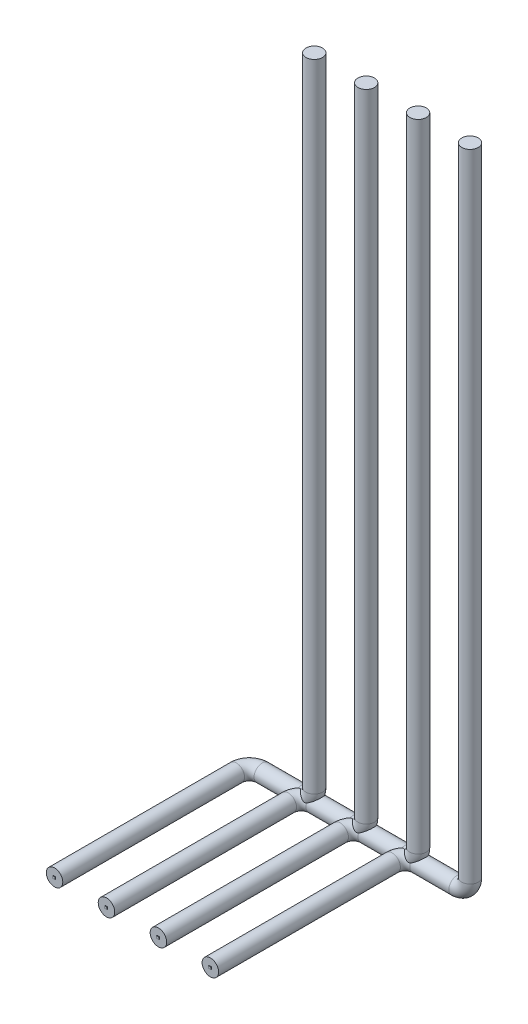
ISO-10303-21;
HEADER;
FILE_DESCRIPTION(('STEP AP214'),'2;1');
FILE_NAME('part.step','',(''),(''),'','','');
FILE_SCHEMA(('AUTOMOTIVE_DESIGN { 1 0 10303 214 1 1 1 1 }'));
ENDSEC;
DATA;
#1=APPLICATION_CONTEXT('core data for automotive mechanical design processes');
#2=APPLICATION_PROTOCOL_DEFINITION('international standard','automotive_design',2000,#1);
#3=PRODUCT_CONTEXT('',#1,'mechanical');
#4=PRODUCT('Part','Part','',(#3));
#5=PRODUCT_RELATED_PRODUCT_CATEGORY('part','',(#4));
#6=PRODUCT_DEFINITION_FORMATION('','',#4);
#7=PRODUCT_DEFINITION_CONTEXT('part definition',#1,'design');
#8=PRODUCT_DEFINITION('design','',#6,#7);
#9=PRODUCT_DEFINITION_SHAPE('','',#8);
#10=(LENGTH_UNIT() NAMED_UNIT(*) SI_UNIT(.MILLI.,.METRE.));
#11=(NAMED_UNIT(*) PLANE_ANGLE_UNIT() SI_UNIT($,.RADIAN.));
#12=(NAMED_UNIT(*) SI_UNIT($,.STERADIAN.) SOLID_ANGLE_UNIT());
#13=UNCERTAINTY_MEASURE_WITH_UNIT(LENGTH_MEASURE(1.E-05),#10,'distance_accuracy_value','');
#14=(GEOMETRIC_REPRESENTATION_CONTEXT(3) GLOBAL_UNCERTAINTY_ASSIGNED_CONTEXT((#13)) GLOBAL_UNIT_ASSIGNED_CONTEXT((#10,
#11,#12)) REPRESENTATION_CONTEXT('',''));
#15=CARTESIAN_POINT('',(0.,0.,0.));
#16=DIRECTION('',(0.,0.,1.));
#17=DIRECTION('',(1.,0.,0.));
#18=AXIS2_PLACEMENT_3D('',#15,#16,#17);
#19=CARTESIAN_POINT('',(240.,0.,0.));
#20=DIRECTION('',(0.,0.,1.));
#21=DIRECTION('',(1.,0.,0.));
#22=AXIS2_PLACEMENT_3D('',#19,#20,#21);
#23=PLANE('',#22);
#24=CARTESIAN_POINT('',(240.,0.,0.));
#25=DIRECTION('',(0.,0.,1.));
#26=DIRECTION('',(1.,0.,0.));
#27=AXIS2_PLACEMENT_3D('',#24,#25,#26);
#28=CIRCLE('',#27,12.7);
#29=CARTESIAN_POINT('',(252.7,0.,0.));
#30=VERTEX_POINT('',#29);
#31=EDGE_CURVE('E64',#30,#30,#28,.T.);
#32=ORIENTED_EDGE('',*,*,#31,.T.);
#33=EDGE_LOOP('',(#32));
#34=FACE_BOUND('',#33,.T.);
#35=DIRECTION('',(-1.,0.,0.));
#36=VECTOR('',#35,1.);
#37=CARTESIAN_POINT('',(238.188257404063,1.656281223361,0.));
#38=LINE('',#37,#36);
#39=CARTESIAN_POINT('',(241.811742595937,1.656281223361,0.));
#40=VERTEX_POINT('',#39);
#41=CARTESIAN_POINT('',(238.188257404063,1.656281223361,0.));
#42=VERTEX_POINT('',#41);
#43=EDGE_CURVE('E153',#40,#42,#38,.T.);
#44=ORIENTED_EDGE('',*,*,#43,.F.);
#45=DIRECTION('',(0.,1.,0.));
#46=VECTOR('',#45,1.);
#47=CARTESIAN_POINT('',(241.811742595937,-1.656281223361,0.));
#48=LINE('',#47,#46);
#49=CARTESIAN_POINT('',(241.811742595937,-1.656281223361,0.));
#50=VERTEX_POINT('',#49);
#51=EDGE_CURVE('E111',#50,#40,#48,.T.);
#52=ORIENTED_EDGE('',*,*,#51,.F.);
#53=DIRECTION('',(1.,0.,0.));
#54=VECTOR('',#53,1.);
#55=CARTESIAN_POINT('',(238.188257404063,-1.656281223361,0.));
#56=LINE('',#55,#54);
#57=CARTESIAN_POINT('',(238.188257404063,-1.656281223361,0.));
#58=VERTEX_POINT('',#57);
#59=EDGE_CURVE('E107',#58,#50,#56,.T.);
#60=ORIENTED_EDGE('',*,*,#59,.F.);
#61=DIRECTION('',(0.,-1.,0.));
#62=VECTOR('',#61,1.);
#63=CARTESIAN_POINT('',(238.188257404063,-1.656281223361,0.));
#64=LINE('',#63,#62);
#65=EDGE_CURVE('E155',#42,#58,#64,.T.);
#66=ORIENTED_EDGE('',*,*,#65,.F.);
#67=EDGE_LOOP('',(#44,#52,#60,#66));
#68=FACE_BOUND('',#67,.T.);
#69=ADVANCED_FACE('F44',(#34,#68),#23,.T.);
#70=CARTESIAN_POINT('',(340.,1000.,-300.));
#71=DIRECTION('',(0.,-1.,0.));
#72=DIRECTION('',(0.,0.,1.));
#73=AXIS2_PLACEMENT_3D('',#70,#71,#72);
#74=PLANE('',#73);
#75=CARTESIAN_POINT('',(340.,1000.,-300.));
#76=DIRECTION('',(0.,-1.,0.));
#77=DIRECTION('',(0.,0.,1.));
#78=AXIS2_PLACEMENT_3D('',#75,#76,#77);
#79=CIRCLE('',#78,12.7);
#80=CARTESIAN_POINT('',(340.,1000.,-287.3));
#81=VERTEX_POINT('',#80);
#82=EDGE_CURVE('E12',#81,#81,#79,.T.);
#83=ORIENTED_EDGE('',*,*,#82,.F.);
#84=EDGE_LOOP('',(#83));
#85=FACE_BOUND('',#84,.T.);
#86=ADVANCED_FACE('F141',(#85),#74,.F.);
#87=CARTESIAN_POINT('',(240.,0.,0.));
#88=DIRECTION('',(0.,0.,-1.));
#89=DIRECTION('',(-1.,0.,0.));
#90=AXIS2_PLACEMENT_3D('',#87,#88,#89);
#91=CYLINDRICAL_SURFACE('',#90,12.7);
#92=CARTESIAN_POINT('',(240.,0.,-280.));
#93=DIRECTION('',(0.,0.,1.));
#94=DIRECTION('',(1.,0.,0.));
#95=AXIS2_PLACEMENT_3D('',#92,#93,#94);
#96=CIRCLE('',#95,12.7);
#97=CARTESIAN_POINT('',(227.3,0.,-280.));
#98=VERTEX_POINT('',#97);
#99=EDGE_CURVE('E114',#98,#98,#96,.T.);
#100=ORIENTED_EDGE('',*,*,#99,.T.);
#101=EDGE_LOOP('',(#100));
#102=FACE_BOUND('',#101,.T.);
#103=ORIENTED_EDGE('',*,*,#31,.F.);
#104=EDGE_LOOP('',(#103));
#105=FACE_BOUND('',#104,.T.);
#106=ADVANCED_FACE('F149',(#102,#105),#91,.T.);
#107=CARTESIAN_POINT('',(260.,0.,-280.));
#108=DIRECTION('',(0.,-1.,0.));
#109=DIRECTION('',(0.,0.,-1.));
#110=AXIS2_PLACEMENT_3D('',#107,#108,#109);
#111=TOROIDAL_SURFACE('',#110,20.,12.7);
#112=CARTESIAN_POINT('',(260.,0.,-300.));
#113=DIRECTION('',(-1.,0.,0.));
#114=DIRECTION('',(0.,0.,1.));
#115=AXIS2_PLACEMENT_3D('',#112,#113,#114);
#116=CIRCLE('',#115,12.7);
#117=CARTESIAN_POINT('',(260.,0.,-312.7));
#118=VERTEX_POINT('',#117);
#119=EDGE_CURVE('E121',#118,#118,#116,.T.);
#120=CARTESIAN_POINT('',(260.,0.,-280.));
#121=DIRECTION('',(0.,-1.,0.));
#122=DIRECTION('',(0.,0.,-1.));
#123=AXIS2_PLACEMENT_3D('',#120,#121,#122);
#124=CIRCLE('',#123,32.7);
#125=EDGE_CURVE('',#98,#118,#124,.T.);
#126=ORIENTED_EDGE('',*,*,#99,.F.);
#127=ORIENTED_EDGE('',*,*,#119,.T.);
#128=ORIENTED_EDGE('',*,*,#125,.T.);
#129=ORIENTED_EDGE('',*,*,#125,.F.);
#130=EDGE_LOOP('',(#126,#128,#127,#129));
#131=FACE_BOUND('',#130,.T.);
#132=ADVANCED_FACE('F180',(#131),#111,.T.);
#133=CARTESIAN_POINT('',(260.,0.,-300.));
#134=DIRECTION('',(1.,0.,0.));
#135=DIRECTION('',(0.,0.,-1.));
#136=AXIS2_PLACEMENT_3D('',#133,#134,#135);
#137=CYLINDRICAL_SURFACE('',#136,12.7);
#138=CARTESIAN_POINT('',(320.,0.,-300.));
#139=DIRECTION('',(-1.,0.,0.));
#140=DIRECTION('',(0.,0.,1.));
#141=AXIS2_PLACEMENT_3D('',#138,#139,#140);
#142=CIRCLE('',#141,12.7);
#143=CARTESIAN_POINT('',(320.,-12.7,-300.));
#144=VERTEX_POINT('',#143);
#145=EDGE_CURVE('E124',#144,#144,#142,.T.);
#146=ORIENTED_EDGE('',*,*,#145,.T.);
#147=EDGE_LOOP('',(#146));
#148=FACE_BOUND('',#147,.T.);
#149=ORIENTED_EDGE('',*,*,#119,.F.);
#150=EDGE_LOOP('',(#149));
#151=FACE_BOUND('',#150,.T.);
#152=ADVANCED_FACE('F142',(#148,#151),#137,.T.);
#153=CARTESIAN_POINT('',(320.,20.,-300.));
#154=DIRECTION('',(0.,0.,1.));
#155=DIRECTION('',(1.,0.,0.));
#156=AXIS2_PLACEMENT_3D('',#153,#154,#155);
#157=TOROIDAL_SURFACE('',#156,20.,12.7);
#158=CARTESIAN_POINT('',(340.,20.,-300.));
#159=DIRECTION('',(0.,-1.,0.));
#160=DIRECTION('',(0.,0.,1.));
#161=AXIS2_PLACEMENT_3D('',#158,#159,#160);
#162=CIRCLE('',#161,12.7);
#163=CARTESIAN_POINT('',(352.7,20.,-300.));
#164=VERTEX_POINT('',#163);
#165=EDGE_CURVE('E51',#164,#164,#162,.T.);
#166=CARTESIAN_POINT('',(320.,20.,-300.));
#167=DIRECTION('',(0.,0.,1.));
#168=DIRECTION('',(1.,0.,0.));
#169=AXIS2_PLACEMENT_3D('',#166,#167,#168);
#170=CIRCLE('',#169,32.7);
#171=EDGE_CURVE('',#144,#164,#170,.T.);
#172=ORIENTED_EDGE('',*,*,#145,.F.);
#173=ORIENTED_EDGE('',*,*,#165,.T.);
#174=ORIENTED_EDGE('',*,*,#171,.T.);
#175=ORIENTED_EDGE('',*,*,#171,.F.);
#176=EDGE_LOOP('',(#172,#174,#173,#175));
#177=FACE_BOUND('',#176,.T.);
#178=ADVANCED_FACE('F129',(#177),#157,.T.);
#179=CARTESIAN_POINT('',(340.,20.,-300.));
#180=DIRECTION('',(0.,1.,0.));
#181=DIRECTION('',(0.,0.,1.));
#182=AXIS2_PLACEMENT_3D('',#179,#180,#181);
#183=CYLINDRICAL_SURFACE('',#182,12.7);
#184=ORIENTED_EDGE('',*,*,#82,.T.);
#185=EDGE_LOOP('',(#184));
#186=FACE_BOUND('',#185,.T.);
#187=ORIENTED_EDGE('',*,*,#165,.F.);
#188=EDGE_LOOP('',(#187));
#189=FACE_BOUND('',#188,.T.);
#190=ADVANCED_FACE('F132',(#186,#189),#183,.T.);
#191=CARTESIAN_POINT('',(241.811742595937,-1.656281223361,1.));
#192=DIRECTION('',(-1.,0.,0.));
#193=DIRECTION('',(0.,0.,1.));
#194=AXIS2_PLACEMENT_3D('',#191,#192,#193);
#195=PLANE('',#194);
#196=ORIENTED_EDGE('',*,*,#51,.T.);
#197=DIRECTION('',(0.,0.,-1.));
#198=VECTOR('',#197,1.);
#199=CARTESIAN_POINT('',(241.811742595937,1.656281223361,1.));
#200=LINE('',#199,#198);
#201=CARTESIAN_POINT('',(241.811742595937,1.656281223361,1.));
#202=VERTEX_POINT('',#201);
#203=EDGE_CURVE('E92',#202,#40,#200,.T.);
#204=ORIENTED_EDGE('',*,*,#203,.F.);
#205=DIRECTION('',(0.,1.,0.));
#206=VECTOR('',#205,1.);
#207=CARTESIAN_POINT('',(241.811742595937,-1.656281223361,1.));
#208=LINE('',#207,#206);
#209=CARTESIAN_POINT('',(241.811742595937,-1.656281223361,1.));
#210=VERTEX_POINT('',#209);
#211=EDGE_CURVE('E99',#210,#202,#208,.T.);
#212=ORIENTED_EDGE('',*,*,#211,.F.);
#213=DIRECTION('',(0.,0.,-1.));
#214=VECTOR('',#213,1.);
#215=CARTESIAN_POINT('',(241.811742595937,-1.656281223361,1.));
#216=LINE('',#215,#214);
#217=EDGE_CURVE('E162',#210,#50,#216,.T.);
#218=ORIENTED_EDGE('',*,*,#217,.T.);
#219=EDGE_LOOP('',(#196,#204,#212,#218));
#220=FACE_BOUND('',#219,.T.);
#221=ADVANCED_FACE('F109',(#220),#195,.F.);
#222=CARTESIAN_POINT('',(238.188257404063,1.656281223361,1.));
#223=DIRECTION('',(0.,-1.,0.));
#224=DIRECTION('',(0.,0.,-1.));
#225=AXIS2_PLACEMENT_3D('',#222,#223,#224);
#226=PLANE('',#225);
#227=ORIENTED_EDGE('',*,*,#43,.T.);
#228=DIRECTION('',(0.,0.,-1.));
#229=VECTOR('',#228,1.);
#230=CARTESIAN_POINT('',(238.188257404063,1.656281223361,1.));
#231=LINE('',#230,#229);
#232=CARTESIAN_POINT('',(238.188257404063,1.656281223361,1.));
#233=VERTEX_POINT('',#232);
#234=EDGE_CURVE('E95',#233,#42,#231,.T.);
#235=ORIENTED_EDGE('',*,*,#234,.F.);
#236=DIRECTION('',(-1.,0.,0.));
#237=VECTOR('',#236,1.);
#238=CARTESIAN_POINT('',(238.188257404063,1.656281223361,1.));
#239=LINE('',#238,#237);
#240=EDGE_CURVE('E88',#202,#233,#239,.T.);
#241=ORIENTED_EDGE('',*,*,#240,.F.);
#242=ORIENTED_EDGE('',*,*,#203,.T.);
#243=EDGE_LOOP('',(#227,#235,#241,#242));
#244=FACE_BOUND('',#243,.T.);
#245=ADVANCED_FACE('F90',(#244),#226,.F.);
#246=CARTESIAN_POINT('',(238.188257404063,-1.656281223361,1.));
#247=DIRECTION('',(1.,0.,0.));
#248=DIRECTION('',(0.,0.,-1.));
#249=AXIS2_PLACEMENT_3D('',#246,#247,#248);
#250=PLANE('',#249);
#251=ORIENTED_EDGE('',*,*,#65,.T.);
#252=DIRECTION('',(0.,0.,-1.));
#253=VECTOR('',#252,1.);
#254=CARTESIAN_POINT('',(238.188257404063,-1.656281223361,1.));
#255=LINE('',#254,#253);
#256=CARTESIAN_POINT('',(238.188257404063,-1.656281223361,1.));
#257=VERTEX_POINT('',#256);
#258=EDGE_CURVE('E58',#257,#58,#255,.T.);
#259=ORIENTED_EDGE('',*,*,#258,.F.);
#260=DIRECTION('',(0.,-1.,0.));
#261=VECTOR('',#260,1.);
#262=CARTESIAN_POINT('',(238.188257404063,-1.656281223361,1.));
#263=LINE('',#262,#261);
#264=EDGE_CURVE('E98',#233,#257,#263,.T.);
#265=ORIENTED_EDGE('',*,*,#264,.F.);
#266=ORIENTED_EDGE('',*,*,#234,.T.);
#267=EDGE_LOOP('',(#251,#259,#265,#266));
#268=FACE_BOUND('',#267,.T.);
#269=ADVANCED_FACE('F165',(#268),#250,.F.);
#270=CARTESIAN_POINT('',(238.188257404063,-1.656281223361,1.));
#271=DIRECTION('',(0.,1.,0.));
#272=DIRECTION('',(0.,0.,1.));
#273=AXIS2_PLACEMENT_3D('',#270,#271,#272);
#274=PLANE('',#273);
#275=ORIENTED_EDGE('',*,*,#59,.T.);
#276=ORIENTED_EDGE('',*,*,#217,.F.);
#277=DIRECTION('',(1.,0.,0.));
#278=VECTOR('',#277,1.);
#279=CARTESIAN_POINT('',(238.188257404063,-1.656281223361,1.));
#280=LINE('',#279,#278);
#281=EDGE_CURVE('E103',#257,#210,#280,.T.);
#282=ORIENTED_EDGE('',*,*,#281,.F.);
#283=ORIENTED_EDGE('',*,*,#258,.T.);
#284=EDGE_LOOP('',(#275,#276,#282,#283));
#285=FACE_BOUND('',#284,.T.);
#286=ADVANCED_FACE('F166',(#285),#274,.F.);
#287=CARTESIAN_POINT('',(240.,0.,1.));
#288=DIRECTION('',(0.,0.,-1.));
#289=DIRECTION('',(-1.,0.,0.));
#290=AXIS2_PLACEMENT_3D('',#287,#288,#289);
#291=PLANE('',#290);
#292=ORIENTED_EDGE('',*,*,#211,.T.);
#293=ORIENTED_EDGE('',*,*,#240,.T.);
#294=ORIENTED_EDGE('',*,*,#264,.T.);
#295=ORIENTED_EDGE('',*,*,#281,.T.);
#296=EDGE_LOOP('',(#292,#293,#294,#295));
#297=FACE_BOUND('',#296,.T.);
#298=ADVANCED_FACE('F102',(#297),#291,.F.);
#299=CLOSED_SHELL('',(#69,#86,#106,#132,#152,#178,#190,#221,#245,#269,#286,#298));
#300=MANIFOLD_SOLID_BREP('B2',#299);
#301=CARTESIAN_POINT('',(160.,0.,0.));
#302=DIRECTION('',(0.,0.,1.));
#303=DIRECTION('',(1.,0.,0.));
#304=AXIS2_PLACEMENT_3D('',#301,#302,#303);
#305=PLANE('',#304);
#306=CARTESIAN_POINT('',(160.,0.,0.));
#307=DIRECTION('',(0.,0.,1.));
#308=DIRECTION('',(1.,0.,0.));
#309=AXIS2_PLACEMENT_3D('',#306,#307,#308);
#310=CIRCLE('',#309,12.7);
#311=CARTESIAN_POINT('',(172.7,0.,0.));
#312=VERTEX_POINT('',#311);
#313=EDGE_CURVE('E292',#312,#312,#310,.T.);
#314=ORIENTED_EDGE('',*,*,#313,.T.);
#315=EDGE_LOOP('',(#314));
#316=FACE_BOUND('',#315,.T.);
#317=DIRECTION('',(-1.,0.,0.));
#318=VECTOR('',#317,1.);
#319=CARTESIAN_POINT('',(158.188257404063,1.656281223361,0.));
#320=LINE('',#319,#318);
#321=CARTESIAN_POINT('',(161.811742595937,1.656281223361,0.));
#322=VERTEX_POINT('',#321);
#323=CARTESIAN_POINT('',(158.188257404063,1.656281223361,0.));
#324=VERTEX_POINT('',#323);
#325=EDGE_CURVE('E381',#322,#324,#320,.T.);
#326=ORIENTED_EDGE('',*,*,#325,.F.);
#327=DIRECTION('',(0.,1.,0.));
#328=VECTOR('',#327,1.);
#329=CARTESIAN_POINT('',(161.811742595937,-1.656281223361,0.));
#330=LINE('',#329,#328);
#331=CARTESIAN_POINT('',(161.811742595937,-1.656281223361,0.));
#332=VERTEX_POINT('',#331);
#333=EDGE_CURVE('E339',#332,#322,#330,.T.);
#334=ORIENTED_EDGE('',*,*,#333,.F.);
#335=DIRECTION('',(1.,0.,0.));
#336=VECTOR('',#335,1.);
#337=CARTESIAN_POINT('',(158.188257404063,-1.656281223361,0.));
#338=LINE('',#337,#336);
#339=CARTESIAN_POINT('',(158.188257404063,-1.656281223361,0.));
#340=VERTEX_POINT('',#339);
#341=EDGE_CURVE('E335',#340,#332,#338,.T.);
#342=ORIENTED_EDGE('',*,*,#341,.F.);
#343=DIRECTION('',(0.,-1.,0.));
#344=VECTOR('',#343,1.);
#345=CARTESIAN_POINT('',(158.188257404063,-1.656281223361,0.));
#346=LINE('',#345,#344);
#347=EDGE_CURVE('E383',#324,#340,#346,.T.);
#348=ORIENTED_EDGE('',*,*,#347,.F.);
#349=EDGE_LOOP('',(#326,#334,#342,#348));
#350=FACE_BOUND('',#349,.T.);
#351=ADVANCED_FACE('F272',(#316,#350),#305,.T.);
#352=CARTESIAN_POINT('',(260.,1000.,-300.));
#353=DIRECTION('',(0.,-1.,0.));
#354=DIRECTION('',(0.,0.,1.));
#355=AXIS2_PLACEMENT_3D('',#352,#353,#354);
#356=PLANE('',#355);
#357=CARTESIAN_POINT('',(260.,1000.,-300.));
#358=DIRECTION('',(0.,-1.,0.));
#359=DIRECTION('',(0.,0.,1.));
#360=AXIS2_PLACEMENT_3D('',#357,#358,#359);
#361=CIRCLE('',#360,12.7);
#362=CARTESIAN_POINT('',(260.,1000.,-287.3));
#363=VERTEX_POINT('',#362);
#364=EDGE_CURVE('E42',#363,#363,#361,.T.);
#365=ORIENTED_EDGE('',*,*,#364,.F.);
#366=EDGE_LOOP('',(#365));
#367=FACE_BOUND('',#366,.T.);
#368=ADVANCED_FACE('F369',(#367),#356,.F.);
#369=CARTESIAN_POINT('',(160.,0.,0.));
#370=DIRECTION('',(0.,0.,-1.));
#371=DIRECTION('',(-1.,0.,0.));
#372=AXIS2_PLACEMENT_3D('',#369,#370,#371);
#373=CYLINDRICAL_SURFACE('',#372,12.7);
#374=CARTESIAN_POINT('',(160.,0.,-280.));
#375=DIRECTION('',(0.,0.,1.));
#376=DIRECTION('',(1.,0.,0.));
#377=AXIS2_PLACEMENT_3D('',#374,#375,#376);
#378=CIRCLE('',#377,12.7);
#379=CARTESIAN_POINT('',(147.3,0.,-280.));
#380=VERTEX_POINT('',#379);
#381=EDGE_CURVE('E342',#380,#380,#378,.T.);
#382=ORIENTED_EDGE('',*,*,#381,.T.);
#383=EDGE_LOOP('',(#382));
#384=FACE_BOUND('',#383,.T.);
#385=ORIENTED_EDGE('',*,*,#313,.F.);
#386=EDGE_LOOP('',(#385));
#387=FACE_BOUND('',#386,.T.);
#388=ADVANCED_FACE('F377',(#384,#387),#373,.T.);
#389=CARTESIAN_POINT('',(180.,0.,-280.));
#390=DIRECTION('',(0.,-1.,0.));
#391=DIRECTION('',(0.,0.,-1.));
#392=AXIS2_PLACEMENT_3D('',#389,#390,#391);
#393=TOROIDAL_SURFACE('',#392,20.,12.7);
#394=CARTESIAN_POINT('',(180.,0.,-300.));
#395=DIRECTION('',(-1.,0.,0.));
#396=DIRECTION('',(0.,0.,1.));
#397=AXIS2_PLACEMENT_3D('',#394,#395,#396);
#398=CIRCLE('',#397,12.7);
#399=CARTESIAN_POINT('',(180.,0.,-312.7));
#400=VERTEX_POINT('',#399);
#401=EDGE_CURVE('E349',#400,#400,#398,.T.);
#402=CARTESIAN_POINT('',(180.,0.,-280.));
#403=DIRECTION('',(0.,-1.,0.));
#404=DIRECTION('',(0.,0.,-1.));
#405=AXIS2_PLACEMENT_3D('',#402,#403,#404);
#406=CIRCLE('',#405,32.7);
#407=EDGE_CURVE('',#380,#400,#406,.T.);
#408=ORIENTED_EDGE('',*,*,#381,.F.);
#409=ORIENTED_EDGE('',*,*,#401,.T.);
#410=ORIENTED_EDGE('',*,*,#407,.T.);
#411=ORIENTED_EDGE('',*,*,#407,.F.);
#412=EDGE_LOOP('',(#408,#410,#409,#411));
#413=FACE_BOUND('',#412,.T.);
#414=ADVANCED_FACE('F408',(#413),#393,.T.);
#415=CARTESIAN_POINT('',(180.,0.,-300.));
#416=DIRECTION('',(1.,0.,0.));
#417=DIRECTION('',(0.,0.,-1.));
#418=AXIS2_PLACEMENT_3D('',#415,#416,#417);
#419=CYLINDRICAL_SURFACE('',#418,12.7);
#420=CARTESIAN_POINT('',(240.,0.,-300.));
#421=DIRECTION('',(-1.,0.,0.));
#422=DIRECTION('',(0.,0.,1.));
#423=AXIS2_PLACEMENT_3D('',#420,#421,#422);
#424=CIRCLE('',#423,12.7);
#425=CARTESIAN_POINT('',(240.,-12.7,-300.));
#426=VERTEX_POINT('',#425);
#427=EDGE_CURVE('E352',#426,#426,#424,.T.);
#428=ORIENTED_EDGE('',*,*,#427,.T.);
#429=EDGE_LOOP('',(#428));
#430=FACE_BOUND('',#429,.T.);
#431=ORIENTED_EDGE('',*,*,#401,.F.);
#432=EDGE_LOOP('',(#431));
#433=FACE_BOUND('',#432,.T.);
#434=ADVANCED_FACE('F370',(#430,#433),#419,.T.);
#435=CARTESIAN_POINT('',(240.,20.,-300.));
#436=DIRECTION('',(0.,0.,1.));
#437=DIRECTION('',(1.,0.,0.));
#438=AXIS2_PLACEMENT_3D('',#435,#436,#437);
#439=TOROIDAL_SURFACE('',#438,20.,12.7);
#440=CARTESIAN_POINT('',(260.,20.,-300.));
#441=DIRECTION('',(0.,-1.,0.));
#442=DIRECTION('',(0.,0.,1.));
#443=AXIS2_PLACEMENT_3D('',#440,#441,#442);
#444=CIRCLE('',#443,12.7);
#445=CARTESIAN_POINT('',(272.7,20.,-300.));
#446=VERTEX_POINT('',#445);
#447=EDGE_CURVE('E279',#446,#446,#444,.T.);
#448=CARTESIAN_POINT('',(240.,20.,-300.));
#449=DIRECTION('',(0.,0.,1.));
#450=DIRECTION('',(1.,0.,0.));
#451=AXIS2_PLACEMENT_3D('',#448,#449,#450);
#452=CIRCLE('',#451,32.7);
#453=EDGE_CURVE('',#426,#446,#452,.T.);
#454=ORIENTED_EDGE('',*,*,#427,.F.);
#455=ORIENTED_EDGE('',*,*,#447,.T.);
#456=ORIENTED_EDGE('',*,*,#453,.T.);
#457=ORIENTED_EDGE('',*,*,#453,.F.);
#458=EDGE_LOOP('',(#454,#456,#455,#457));
#459=FACE_BOUND('',#458,.T.);
#460=ADVANCED_FACE('F357',(#459),#439,.T.);
#461=CARTESIAN_POINT('',(260.,20.,-300.));
#462=DIRECTION('',(0.,1.,0.));
#463=DIRECTION('',(0.,0.,1.));
#464=AXIS2_PLACEMENT_3D('',#461,#462,#463);
#465=CYLINDRICAL_SURFACE('',#464,12.7);
#466=ORIENTED_EDGE('',*,*,#364,.T.);
#467=EDGE_LOOP('',(#466));
#468=FACE_BOUND('',#467,.T.);
#469=ORIENTED_EDGE('',*,*,#447,.F.);
#470=EDGE_LOOP('',(#469));
#471=FACE_BOUND('',#470,.T.);
#472=ADVANCED_FACE('F360',(#468,#471),#465,.T.);
#473=CARTESIAN_POINT('',(161.811742595937,-1.656281223361,1.));
#474=DIRECTION('',(-1.,0.,0.));
#475=DIRECTION('',(0.,0.,1.));
#476=AXIS2_PLACEMENT_3D('',#473,#474,#475);
#477=PLANE('',#476);
#478=ORIENTED_EDGE('',*,*,#333,.T.);
#479=DIRECTION('',(0.,0.,-1.));
#480=VECTOR('',#479,1.);
#481=CARTESIAN_POINT('',(161.811742595937,1.656281223361,1.));
#482=LINE('',#481,#480);
#483=CARTESIAN_POINT('',(161.811742595937,1.656281223361,1.));
#484=VERTEX_POINT('',#483);
#485=EDGE_CURVE('E320',#484,#322,#482,.T.);
#486=ORIENTED_EDGE('',*,*,#485,.F.);
#487=DIRECTION('',(0.,1.,0.));
#488=VECTOR('',#487,1.);
#489=CARTESIAN_POINT('',(161.811742595937,-1.656281223361,1.));
#490=LINE('',#489,#488);
#491=CARTESIAN_POINT('',(161.811742595937,-1.656281223361,1.));
#492=VERTEX_POINT('',#491);
#493=EDGE_CURVE('E327',#492,#484,#490,.T.);
#494=ORIENTED_EDGE('',*,*,#493,.F.);
#495=DIRECTION('',(0.,0.,-1.));
#496=VECTOR('',#495,1.);
#497=CARTESIAN_POINT('',(161.811742595937,-1.656281223361,1.));
#498=LINE('',#497,#496);
#499=EDGE_CURVE('E390',#492,#332,#498,.T.);
#500=ORIENTED_EDGE('',*,*,#499,.T.);
#501=EDGE_LOOP('',(#478,#486,#494,#500));
#502=FACE_BOUND('',#501,.T.);
#503=ADVANCED_FACE('F337',(#502),#477,.F.);
#504=CARTESIAN_POINT('',(158.188257404063,1.656281223361,1.));
#505=DIRECTION('',(0.,-1.,0.));
#506=DIRECTION('',(0.,0.,-1.));
#507=AXIS2_PLACEMENT_3D('',#504,#505,#506);
#508=PLANE('',#507);
#509=ORIENTED_EDGE('',*,*,#325,.T.);
#510=DIRECTION('',(0.,0.,-1.));
#511=VECTOR('',#510,1.);
#512=CARTESIAN_POINT('',(158.188257404063,1.656281223361,1.));
#513=LINE('',#512,#511);
#514=CARTESIAN_POINT('',(158.188257404063,1.656281223361,1.));
#515=VERTEX_POINT('',#514);
#516=EDGE_CURVE('E323',#515,#324,#513,.T.);
#517=ORIENTED_EDGE('',*,*,#516,.F.);
#518=DIRECTION('',(-1.,0.,0.));
#519=VECTOR('',#518,1.);
#520=CARTESIAN_POINT('',(158.188257404063,1.656281223361,1.));
#521=LINE('',#520,#519);
#522=EDGE_CURVE('E316',#484,#515,#521,.T.);
#523=ORIENTED_EDGE('',*,*,#522,.F.);
#524=ORIENTED_EDGE('',*,*,#485,.T.);
#525=EDGE_LOOP('',(#509,#517,#523,#524));
#526=FACE_BOUND('',#525,.T.);
#527=ADVANCED_FACE('F318',(#526),#508,.F.);
#528=CARTESIAN_POINT('',(158.188257404063,-1.656281223361,1.));
#529=DIRECTION('',(1.,0.,0.));
#530=DIRECTION('',(0.,0.,-1.));
#531=AXIS2_PLACEMENT_3D('',#528,#529,#530);
#532=PLANE('',#531);
#533=ORIENTED_EDGE('',*,*,#347,.T.);
#534=DIRECTION('',(0.,0.,-1.));
#535=VECTOR('',#534,1.);
#536=CARTESIAN_POINT('',(158.188257404063,-1.656281223361,1.));
#537=LINE('',#536,#535);
#538=CARTESIAN_POINT('',(158.188257404063,-1.656281223361,1.));
#539=VERTEX_POINT('',#538);
#540=EDGE_CURVE('E286',#539,#340,#537,.T.);
#541=ORIENTED_EDGE('',*,*,#540,.F.);
#542=DIRECTION('',(0.,-1.,0.));
#543=VECTOR('',#542,1.);
#544=CARTESIAN_POINT('',(158.188257404063,-1.656281223361,1.));
#545=LINE('',#544,#543);
#546=EDGE_CURVE('E326',#515,#539,#545,.T.);
#547=ORIENTED_EDGE('',*,*,#546,.F.);
#548=ORIENTED_EDGE('',*,*,#516,.T.);
#549=EDGE_LOOP('',(#533,#541,#547,#548));
#550=FACE_BOUND('',#549,.T.);
#551=ADVANCED_FACE('F393',(#550),#532,.F.);
#552=CARTESIAN_POINT('',(158.188257404063,-1.656281223361,1.));
#553=DIRECTION('',(0.,1.,0.));
#554=DIRECTION('',(0.,0.,1.));
#555=AXIS2_PLACEMENT_3D('',#552,#553,#554);
#556=PLANE('',#555);
#557=ORIENTED_EDGE('',*,*,#341,.T.);
#558=ORIENTED_EDGE('',*,*,#499,.F.);
#559=DIRECTION('',(1.,0.,0.));
#560=VECTOR('',#559,1.);
#561=CARTESIAN_POINT('',(158.188257404063,-1.656281223361,1.));
#562=LINE('',#561,#560);
#563=EDGE_CURVE('E331',#539,#492,#562,.T.);
#564=ORIENTED_EDGE('',*,*,#563,.F.);
#565=ORIENTED_EDGE('',*,*,#540,.T.);
#566=EDGE_LOOP('',(#557,#558,#564,#565));
#567=FACE_BOUND('',#566,.T.);
#568=ADVANCED_FACE('F394',(#567),#556,.F.);
#569=CARTESIAN_POINT('',(160.,0.,1.));
#570=DIRECTION('',(0.,0.,-1.));
#571=DIRECTION('',(-1.,0.,0.));
#572=AXIS2_PLACEMENT_3D('',#569,#570,#571);
#573=PLANE('',#572);
#574=ORIENTED_EDGE('',*,*,#493,.T.);
#575=ORIENTED_EDGE('',*,*,#522,.T.);
#576=ORIENTED_EDGE('',*,*,#546,.T.);
#577=ORIENTED_EDGE('',*,*,#563,.T.);
#578=EDGE_LOOP('',(#574,#575,#576,#577));
#579=FACE_BOUND('',#578,.T.);
#580=ADVANCED_FACE('F330',(#579),#573,.F.);
#581=CLOSED_SHELL('',(#351,#368,#388,#414,#434,#460,#472,#503,#527,#551,#568,#580));
#582=MANIFOLD_SOLID_BREP('B6',#581);
#583=CARTESIAN_POINT('',(80.,0.,0.));
#584=DIRECTION('',(0.,0.,1.));
#585=DIRECTION('',(1.,0.,0.));
#586=AXIS2_PLACEMENT_3D('',#583,#584,#585);
#587=PLANE('',#586);
#588=CARTESIAN_POINT('',(80.,0.,0.));
#589=DIRECTION('',(0.,0.,1.));
#590=DIRECTION('',(1.,0.,0.));
#591=AXIS2_PLACEMENT_3D('',#588,#589,#590);
#592=CIRCLE('',#591,12.7);
#593=CARTESIAN_POINT('',(92.7,0.,0.));
#594=VERTEX_POINT('',#593);
#595=EDGE_CURVE('E519',#594,#594,#592,.T.);
#596=ORIENTED_EDGE('',*,*,#595,.T.);
#597=EDGE_LOOP('',(#596));
#598=FACE_BOUND('',#597,.T.);
#599=DIRECTION('',(-1.,0.,0.));
#600=VECTOR('',#599,1.);
#601=CARTESIAN_POINT('',(78.1882574040631,1.656281223361,0.));
#602=LINE('',#601,#600);
#603=CARTESIAN_POINT('',(81.8117425959369,1.656281223361,0.));
#604=VERTEX_POINT('',#603);
#605=CARTESIAN_POINT('',(78.1882574040631,1.656281223361,0.));
#606=VERTEX_POINT('',#605);
#607=EDGE_CURVE('E608',#604,#606,#602,.T.);
#608=ORIENTED_EDGE('',*,*,#607,.F.);
#609=DIRECTION('',(0.,1.,0.));
#610=VECTOR('',#609,1.);
#611=CARTESIAN_POINT('',(81.8117425959369,-1.656281223361,0.));
#612=LINE('',#611,#610);
#613=CARTESIAN_POINT('',(81.8117425959369,-1.656281223361,0.));
#614=VERTEX_POINT('',#613);
#615=EDGE_CURVE('E566',#614,#604,#612,.T.);
#616=ORIENTED_EDGE('',*,*,#615,.F.);
#617=DIRECTION('',(1.,0.,0.));
#618=VECTOR('',#617,1.);
#619=CARTESIAN_POINT('',(78.1882574040631,-1.656281223361,0.));
#620=LINE('',#619,#618);
#621=CARTESIAN_POINT('',(78.1882574040631,-1.656281223361,0.));
#622=VERTEX_POINT('',#621);
#623=EDGE_CURVE('E562',#622,#614,#620,.T.);
#624=ORIENTED_EDGE('',*,*,#623,.F.);
#625=DIRECTION('',(0.,-1.,0.));
#626=VECTOR('',#625,1.);
#627=CARTESIAN_POINT('',(78.1882574040631,-1.656281223361,0.));
#628=LINE('',#627,#626);
#629=EDGE_CURVE('E610',#606,#622,#628,.T.);
#630=ORIENTED_EDGE('',*,*,#629,.F.);
#631=EDGE_LOOP('',(#608,#616,#624,#630));
#632=FACE_BOUND('',#631,.T.);
#633=ADVANCED_FACE('F499',(#598,#632),#587,.T.);
#634=CARTESIAN_POINT('',(180.,1000.,-300.));
#635=DIRECTION('',(0.,-1.,0.));
#636=DIRECTION('',(0.,0.,1.));
#637=AXIS2_PLACEMENT_3D('',#634,#635,#636);
#638=PLANE('',#637);
#639=CARTESIAN_POINT('',(180.,1000.,-300.));
#640=DIRECTION('',(0.,-1.,0.));
#641=DIRECTION('',(0.,0.,1.));
#642=AXIS2_PLACEMENT_3D('',#639,#640,#641);
#643=CIRCLE('',#642,12.7);
#644=CARTESIAN_POINT('',(180.,1000.,-287.3));
#645=VERTEX_POINT('',#644);
#646=EDGE_CURVE('E270',#645,#645,#643,.T.);
#647=ORIENTED_EDGE('',*,*,#646,.F.);
#648=EDGE_LOOP('',(#647));
#649=FACE_BOUND('',#648,.T.);
#650=ADVANCED_FACE('F596',(#649),#638,.F.);
#651=CARTESIAN_POINT('',(80.,0.,0.));
#652=DIRECTION('',(0.,0.,-1.));
#653=DIRECTION('',(-1.,0.,0.));
#654=AXIS2_PLACEMENT_3D('',#651,#652,#653);
#655=CYLINDRICAL_SURFACE('',#654,12.7);
#656=CARTESIAN_POINT('',(80.,0.,-280.));
#657=DIRECTION('',(0.,0.,1.));
#658=DIRECTION('',(1.,0.,0.));
#659=AXIS2_PLACEMENT_3D('',#656,#657,#658);
#660=CIRCLE('',#659,12.7);
#661=CARTESIAN_POINT('',(67.3,0.,-280.));
#662=VERTEX_POINT('',#661);
#663=EDGE_CURVE('E569',#662,#662,#660,.T.);
#664=ORIENTED_EDGE('',*,*,#663,.T.);
#665=EDGE_LOOP('',(#664));
#666=FACE_BOUND('',#665,.T.);
#667=ORIENTED_EDGE('',*,*,#595,.F.);
#668=EDGE_LOOP('',(#667));
#669=FACE_BOUND('',#668,.T.);
#670=ADVANCED_FACE('F604',(#666,#669),#655,.T.);
#671=CARTESIAN_POINT('',(100.,0.,-280.));
#672=DIRECTION('',(0.,-1.,0.));
#673=DIRECTION('',(0.,0.,-1.));
#674=AXIS2_PLACEMENT_3D('',#671,#672,#673);
#675=TOROIDAL_SURFACE('',#674,20.,12.7);
#676=CARTESIAN_POINT('',(100.,0.,-300.));
#677=DIRECTION('',(-1.,0.,0.));
#678=DIRECTION('',(0.,0.,1.));
#679=AXIS2_PLACEMENT_3D('',#676,#677,#678);
#680=CIRCLE('',#679,12.7);
#681=CARTESIAN_POINT('',(100.,0.,-312.7));
#682=VERTEX_POINT('',#681);
#683=EDGE_CURVE('E576',#682,#682,#680,.T.);
#684=CARTESIAN_POINT('',(100.,0.,-280.));
#685=DIRECTION('',(0.,-1.,0.));
#686=DIRECTION('',(0.,0.,-1.));
#687=AXIS2_PLACEMENT_3D('',#684,#685,#686);
#688=CIRCLE('',#687,32.7);
#689=EDGE_CURVE('',#662,#682,#688,.T.);
#690=ORIENTED_EDGE('',*,*,#663,.F.);
#691=ORIENTED_EDGE('',*,*,#683,.T.);
#692=ORIENTED_EDGE('',*,*,#689,.T.);
#693=ORIENTED_EDGE('',*,*,#689,.F.);
#694=EDGE_LOOP('',(#690,#692,#691,#693));
#695=FACE_BOUND('',#694,.T.);
#696=ADVANCED_FACE('F635',(#695),#675,.T.);
#697=CARTESIAN_POINT('',(100.,0.,-300.));
#698=DIRECTION('',(1.,0.,0.));
#699=DIRECTION('',(0.,0.,-1.));
#700=AXIS2_PLACEMENT_3D('',#697,#698,#699);
#701=CYLINDRICAL_SURFACE('',#700,12.7);
#702=CARTESIAN_POINT('',(160.,0.,-300.));
#703=DIRECTION('',(-1.,0.,0.));
#704=DIRECTION('',(0.,0.,1.));
#705=AXIS2_PLACEMENT_3D('',#702,#703,#704);
#706=CIRCLE('',#705,12.7);
#707=CARTESIAN_POINT('',(160.,-12.7,-300.));
#708=VERTEX_POINT('',#707);
#709=EDGE_CURVE('E579',#708,#708,#706,.T.);
#710=ORIENTED_EDGE('',*,*,#709,.T.);
#711=EDGE_LOOP('',(#710));
#712=FACE_BOUND('',#711,.T.);
#713=ORIENTED_EDGE('',*,*,#683,.F.);
#714=EDGE_LOOP('',(#713));
#715=FACE_BOUND('',#714,.T.);
#716=ADVANCED_FACE('F597',(#712,#715),#701,.T.);
#717=CARTESIAN_POINT('',(160.,20.,-300.));
#718=DIRECTION('',(0.,0.,1.));
#719=DIRECTION('',(1.,0.,0.));
#720=AXIS2_PLACEMENT_3D('',#717,#718,#719);
#721=TOROIDAL_SURFACE('',#720,20.,12.7);
#722=CARTESIAN_POINT('',(180.,20.,-300.));
#723=DIRECTION('',(0.,-1.,0.));
#724=DIRECTION('',(0.,0.,1.));
#725=AXIS2_PLACEMENT_3D('',#722,#723,#724);
#726=CIRCLE('',#725,12.7);
#727=CARTESIAN_POINT('',(192.7,20.,-300.));
#728=VERTEX_POINT('',#727);
#729=EDGE_CURVE('E506',#728,#728,#726,.T.);
#730=CARTESIAN_POINT('',(160.,20.,-300.));
#731=DIRECTION('',(0.,0.,1.));
#732=DIRECTION('',(1.,0.,0.));
#733=AXIS2_PLACEMENT_3D('',#730,#731,#732);
#734=CIRCLE('',#733,32.7);
#735=EDGE_CURVE('',#708,#728,#734,.T.);
#736=ORIENTED_EDGE('',*,*,#709,.F.);
#737=ORIENTED_EDGE('',*,*,#729,.T.);
#738=ORIENTED_EDGE('',*,*,#735,.T.);
#739=ORIENTED_EDGE('',*,*,#735,.F.);
#740=EDGE_LOOP('',(#736,#738,#737,#739));
#741=FACE_BOUND('',#740,.T.);
#742=ADVANCED_FACE('F584',(#741),#721,.T.);
#743=CARTESIAN_POINT('',(180.,20.,-300.));
#744=DIRECTION('',(0.,1.,0.));
#745=DIRECTION('',(0.,0.,1.));
#746=AXIS2_PLACEMENT_3D('',#743,#744,#745);
#747=CYLINDRICAL_SURFACE('',#746,12.7);
#748=ORIENTED_EDGE('',*,*,#646,.T.);
#749=EDGE_LOOP('',(#748));
#750=FACE_BOUND('',#749,.T.);
#751=ORIENTED_EDGE('',*,*,#729,.F.);
#752=EDGE_LOOP('',(#751));
#753=FACE_BOUND('',#752,.T.);
#754=ADVANCED_FACE('F587',(#750,#753),#747,.T.);
#755=CARTESIAN_POINT('',(81.8117425959369,-1.656281223361,1.));
#756=DIRECTION('',(-1.,0.,0.));
#757=DIRECTION('',(0.,0.,1.));
#758=AXIS2_PLACEMENT_3D('',#755,#756,#757);
#759=PLANE('',#758);
#760=ORIENTED_EDGE('',*,*,#615,.T.);
#761=DIRECTION('',(0.,0.,-1.));
#762=VECTOR('',#761,1.);
#763=CARTESIAN_POINT('',(81.8117425959369,1.656281223361,1.));
#764=LINE('',#763,#762);
#765=CARTESIAN_POINT('',(81.8117425959369,1.656281223361,1.));
#766=VERTEX_POINT('',#765);
#767=EDGE_CURVE('E547',#766,#604,#764,.T.);
#768=ORIENTED_EDGE('',*,*,#767,.F.);
#769=DIRECTION('',(0.,1.,0.));
#770=VECTOR('',#769,1.);
#771=CARTESIAN_POINT('',(81.8117425959369,-1.656281223361,1.));
#772=LINE('',#771,#770);
#773=CARTESIAN_POINT('',(81.8117425959369,-1.656281223361,1.));
#774=VERTEX_POINT('',#773);
#775=EDGE_CURVE('E554',#774,#766,#772,.T.);
#776=ORIENTED_EDGE('',*,*,#775,.F.);
#777=DIRECTION('',(0.,0.,-1.));
#778=VECTOR('',#777,1.);
#779=CARTESIAN_POINT('',(81.8117425959369,-1.656281223361,1.));
#780=LINE('',#779,#778);
#781=EDGE_CURVE('E617',#774,#614,#780,.T.);
#782=ORIENTED_EDGE('',*,*,#781,.T.);
#783=EDGE_LOOP('',(#760,#768,#776,#782));
#784=FACE_BOUND('',#783,.T.);
#785=ADVANCED_FACE('F564',(#784),#759,.F.);
#786=CARTESIAN_POINT('',(78.1882574040631,1.656281223361,1.));
#787=DIRECTION('',(0.,-1.,0.));
#788=DIRECTION('',(0.,0.,-1.));
#789=AXIS2_PLACEMENT_3D('',#786,#787,#788);
#790=PLANE('',#789);
#791=ORIENTED_EDGE('',*,*,#607,.T.);
#792=DIRECTION('',(0.,0.,-1.));
#793=VECTOR('',#792,1.);
#794=CARTESIAN_POINT('',(78.1882574040631,1.656281223361,1.));
#795=LINE('',#794,#793);
#796=CARTESIAN_POINT('',(78.1882574040631,1.656281223361,1.));
#797=VERTEX_POINT('',#796);
#798=EDGE_CURVE('E550',#797,#606,#795,.T.);
#799=ORIENTED_EDGE('',*,*,#798,.F.);
#800=DIRECTION('',(-1.,0.,0.));
#801=VECTOR('',#800,1.);
#802=CARTESIAN_POINT('',(78.1882574040631,1.656281223361,1.));
#803=LINE('',#802,#801);
#804=EDGE_CURVE('E543',#766,#797,#803,.T.);
#805=ORIENTED_EDGE('',*,*,#804,.F.);
#806=ORIENTED_EDGE('',*,*,#767,.T.);
#807=EDGE_LOOP('',(#791,#799,#805,#806));
#808=FACE_BOUND('',#807,.T.);
#809=ADVANCED_FACE('F545',(#808),#790,.F.);
#810=CARTESIAN_POINT('',(78.1882574040631,-1.656281223361,1.));
#811=DIRECTION('',(1.,0.,0.));
#812=DIRECTION('',(0.,0.,-1.));
#813=AXIS2_PLACEMENT_3D('',#810,#811,#812);
#814=PLANE('',#813);
#815=ORIENTED_EDGE('',*,*,#629,.T.);
#816=DIRECTION('',(0.,0.,-1.));
#817=VECTOR('',#816,1.);
#818=CARTESIAN_POINT('',(78.1882574040631,-1.656281223361,1.));
#819=LINE('',#818,#817);
#820=CARTESIAN_POINT('',(78.1882574040631,-1.656281223361,1.));
#821=VERTEX_POINT('',#820);
#822=EDGE_CURVE('E513',#821,#622,#819,.T.);
#823=ORIENTED_EDGE('',*,*,#822,.F.);
#824=DIRECTION('',(0.,-1.,0.));
#825=VECTOR('',#824,1.);
#826=CARTESIAN_POINT('',(78.1882574040631,-1.656281223361,1.));
#827=LINE('',#826,#825);
#828=EDGE_CURVE('E553',#797,#821,#827,.T.);
#829=ORIENTED_EDGE('',*,*,#828,.F.);
#830=ORIENTED_EDGE('',*,*,#798,.T.);
#831=EDGE_LOOP('',(#815,#823,#829,#830));
#832=FACE_BOUND('',#831,.T.);
#833=ADVANCED_FACE('F620',(#832),#814,.F.);
#834=CARTESIAN_POINT('',(78.1882574040631,-1.656281223361,1.));
#835=DIRECTION('',(0.,1.,0.));
#836=DIRECTION('',(0.,0.,1.));
#837=AXIS2_PLACEMENT_3D('',#834,#835,#836);
#838=PLANE('',#837);
#839=ORIENTED_EDGE('',*,*,#623,.T.);
#840=ORIENTED_EDGE('',*,*,#781,.F.);
#841=DIRECTION('',(1.,0.,0.));
#842=VECTOR('',#841,1.);
#843=CARTESIAN_POINT('',(78.1882574040631,-1.656281223361,1.));
#844=LINE('',#843,#842);
#845=EDGE_CURVE('E558',#821,#774,#844,.T.);
#846=ORIENTED_EDGE('',*,*,#845,.F.);
#847=ORIENTED_EDGE('',*,*,#822,.T.);
#848=EDGE_LOOP('',(#839,#840,#846,#847));
#849=FACE_BOUND('',#848,.T.);
#850=ADVANCED_FACE('F621',(#849),#838,.F.);
#851=CARTESIAN_POINT('',(80.,0.,1.));
#852=DIRECTION('',(0.,0.,-1.));
#853=DIRECTION('',(-1.,0.,0.));
#854=AXIS2_PLACEMENT_3D('',#851,#852,#853);
#855=PLANE('',#854);
#856=ORIENTED_EDGE('',*,*,#775,.T.);
#857=ORIENTED_EDGE('',*,*,#804,.T.);
#858=ORIENTED_EDGE('',*,*,#828,.T.);
#859=ORIENTED_EDGE('',*,*,#845,.T.);
#860=EDGE_LOOP('',(#856,#857,#858,#859));
#861=FACE_BOUND('',#860,.T.);
#862=ADVANCED_FACE('F557',(#861),#855,.F.);
#863=CLOSED_SHELL('',(#633,#650,#670,#696,#716,#742,#754,#785,#809,#833,#850,#862));
#864=MANIFOLD_SOLID_BREP('B36',#863);
#865=CARTESIAN_POINT('',(0.,0.,0.));
#866=DIRECTION('',(0.,0.,1.));
#867=DIRECTION('',(1.,0.,0.));
#868=AXIS2_PLACEMENT_3D('',#865,#866,#867);
#869=PLANE('',#868);
#870=CARTESIAN_POINT('',(0.,0.,0.));
#871=DIRECTION('',(0.,0.,1.));
#872=DIRECTION('',(1.,0.,0.));
#873=AXIS2_PLACEMENT_3D('',#870,#871,#872);
#874=CIRCLE('',#873,12.7);
#875=CARTESIAN_POINT('',(12.7,0.,0.));
#876=VERTEX_POINT('',#875);
#877=EDGE_CURVE('E737',#876,#876,#874,.T.);
#878=ORIENTED_EDGE('',*,*,#877,.T.);
#879=EDGE_LOOP('',(#878));
#880=FACE_BOUND('',#879,.T.);
#881=DIRECTION('',(-1.,0.,0.));
#882=VECTOR('',#881,1.);
#883=CARTESIAN_POINT('',(-1.81174259593692,1.656281223361,0.));
#884=LINE('',#883,#882);
#885=CARTESIAN_POINT('',(1.81174259593692,1.656281223361,0.));
#886=VERTEX_POINT('',#885);
#887=CARTESIAN_POINT('',(-1.81174259593692,1.656281223361,0.));
#888=VERTEX_POINT('',#887);
#889=EDGE_CURVE('E826',#886,#888,#884,.T.);
#890=ORIENTED_EDGE('',*,*,#889,.F.);
#891=DIRECTION('',(0.,1.,0.));
#892=VECTOR('',#891,1.);
#893=CARTESIAN_POINT('',(1.81174259593692,-1.656281223361,0.));
#894=LINE('',#893,#892);
#895=CARTESIAN_POINT('',(1.81174259593692,-1.656281223361,0.));
#896=VERTEX_POINT('',#895);
#897=EDGE_CURVE('E784',#896,#886,#894,.T.);
#898=ORIENTED_EDGE('',*,*,#897,.F.);
#899=DIRECTION('',(1.,0.,0.));
#900=VECTOR('',#899,1.);
#901=CARTESIAN_POINT('',(-1.81174259593692,-1.656281223361,0.));
#902=LINE('',#901,#900);
#903=CARTESIAN_POINT('',(-1.81174259593692,-1.656281223361,0.));
#904=VERTEX_POINT('',#903);
#905=EDGE_CURVE('E780',#904,#896,#902,.T.);
#906=ORIENTED_EDGE('',*,*,#905,.F.);
#907=DIRECTION('',(0.,-1.,0.));
#908=VECTOR('',#907,1.);
#909=CARTESIAN_POINT('',(-1.81174259593692,-1.656281223361,0.));
#910=LINE('',#909,#908);
#911=EDGE_CURVE('E828',#888,#904,#910,.T.);
#912=ORIENTED_EDGE('',*,*,#911,.F.);
#913=EDGE_LOOP('',(#890,#898,#906,#912));
#914=FACE_BOUND('',#913,.T.);
#915=ADVANCED_FACE('F717',(#880,#914),#869,.T.);
#916=CARTESIAN_POINT('',(100.,1000.,-300.));
#917=DIRECTION('',(0.,-1.,0.));
#918=DIRECTION('',(0.,0.,1.));
#919=AXIS2_PLACEMENT_3D('',#916,#917,#918);
#920=PLANE('',#919);
#921=CARTESIAN_POINT('',(100.,1000.,-300.));
#922=DIRECTION('',(0.,-1.,0.));
#923=DIRECTION('',(0.,0.,1.));
#924=AXIS2_PLACEMENT_3D('',#921,#922,#923);
#925=CIRCLE('',#924,12.7);
#926=CARTESIAN_POINT('',(100.,1000.,-287.3));
#927=VERTEX_POINT('',#926);
#928=EDGE_CURVE('E497',#927,#927,#925,.T.);
#929=ORIENTED_EDGE('',*,*,#928,.F.);
#930=EDGE_LOOP('',(#929));
#931=FACE_BOUND('',#930,.T.);
#932=ADVANCED_FACE('F814',(#931),#920,.F.);
#933=CARTESIAN_POINT('',(0.,0.,0.));
#934=DIRECTION('',(0.,0.,-1.));
#935=DIRECTION('',(-1.,0.,0.));
#936=AXIS2_PLACEMENT_3D('',#933,#934,#935);
#937=CYLINDRICAL_SURFACE('',#936,12.7);
#938=CARTESIAN_POINT('',(0.,0.,-280.));
#939=DIRECTION('',(0.,0.,1.));
#940=DIRECTION('',(1.,0.,0.));
#941=AXIS2_PLACEMENT_3D('',#938,#939,#940);
#942=CIRCLE('',#941,12.7);
#943=CARTESIAN_POINT('',(-12.7,0.,-280.));
#944=VERTEX_POINT('',#943);
#945=EDGE_CURVE('E787',#944,#944,#942,.T.);
#946=ORIENTED_EDGE('',*,*,#945,.T.);
#947=EDGE_LOOP('',(#946));
#948=FACE_BOUND('',#947,.T.);
#949=ORIENTED_EDGE('',*,*,#877,.F.);
#950=EDGE_LOOP('',(#949));
#951=FACE_BOUND('',#950,.T.);
#952=ADVANCED_FACE('F822',(#948,#951),#937,.T.);
#953=CARTESIAN_POINT('',(20.,0.,-280.));
#954=DIRECTION('',(0.,-1.,0.));
#955=DIRECTION('',(0.,0.,-1.));
#956=AXIS2_PLACEMENT_3D('',#953,#954,#955);
#957=TOROIDAL_SURFACE('',#956,20.,12.7);
#958=CARTESIAN_POINT('',(20.,0.,-300.));
#959=DIRECTION('',(-1.,0.,0.));
#960=DIRECTION('',(0.,0.,1.));
#961=AXIS2_PLACEMENT_3D('',#958,#959,#960);
#962=CIRCLE('',#961,12.7);
#963=CARTESIAN_POINT('',(20.,0.,-312.7));
#964=VERTEX_POINT('',#963);
#965=EDGE_CURVE('E794',#964,#964,#962,.T.);
#966=CARTESIAN_POINT('',(20.,0.,-280.));
#967=DIRECTION('',(0.,-1.,0.));
#968=DIRECTION('',(0.,0.,-1.));
#969=AXIS2_PLACEMENT_3D('',#966,#967,#968);
#970=CIRCLE('',#969,32.7);
#971=EDGE_CURVE('',#944,#964,#970,.T.);
#972=ORIENTED_EDGE('',*,*,#945,.F.);
#973=ORIENTED_EDGE('',*,*,#965,.T.);
#974=ORIENTED_EDGE('',*,*,#971,.T.);
#975=ORIENTED_EDGE('',*,*,#971,.F.);
#976=EDGE_LOOP('',(#972,#974,#973,#975));
#977=FACE_BOUND('',#976,.T.);
#978=ADVANCED_FACE('F853',(#977),#957,.T.);
#979=CARTESIAN_POINT('',(20.,0.,-300.));
#980=DIRECTION('',(1.,0.,0.));
#981=DIRECTION('',(0.,0.,-1.));
#982=AXIS2_PLACEMENT_3D('',#979,#980,#981);
#983=CYLINDRICAL_SURFACE('',#982,12.7);
#984=CARTESIAN_POINT('',(80.,0.,-300.));
#985=DIRECTION('',(-1.,0.,0.));
#986=DIRECTION('',(0.,0.,1.));
#987=AXIS2_PLACEMENT_3D('',#984,#985,#986);
#988=CIRCLE('',#987,12.7);
#989=CARTESIAN_POINT('',(80.,-12.7,-300.));
#990=VERTEX_POINT('',#989);
#991=EDGE_CURVE('E797',#990,#990,#988,.T.);
#992=ORIENTED_EDGE('',*,*,#991,.T.);
#993=EDGE_LOOP('',(#992));
#994=FACE_BOUND('',#993,.T.);
#995=ORIENTED_EDGE('',*,*,#965,.F.);
#996=EDGE_LOOP('',(#995));
#997=FACE_BOUND('',#996,.T.);
#998=ADVANCED_FACE('F815',(#994,#997),#983,.T.);
#999=CARTESIAN_POINT('',(80.,20.,-300.));
#1000=DIRECTION('',(0.,0.,1.));
#1001=DIRECTION('',(1.,0.,0.));
#1002=AXIS2_PLACEMENT_3D('',#999,#1000,#1001);
#1003=TOROIDAL_SURFACE('',#1002,20.,12.7);
#1004=CARTESIAN_POINT('',(100.,20.,-300.));
#1005=DIRECTION('',(0.,-1.,0.));
#1006=DIRECTION('',(0.,0.,1.));
#1007=AXIS2_PLACEMENT_3D('',#1004,#1005,#1006);
#1008=CIRCLE('',#1007,12.7);
#1009=CARTESIAN_POINT('',(112.7,20.,-300.));
#1010=VERTEX_POINT('',#1009);
#1011=EDGE_CURVE('E724',#1010,#1010,#1008,.T.);
#1012=CARTESIAN_POINT('',(80.,20.,-300.));
#1013=DIRECTION('',(0.,0.,1.));
#1014=DIRECTION('',(1.,0.,0.));
#1015=AXIS2_PLACEMENT_3D('',#1012,#1013,#1014);
#1016=CIRCLE('',#1015,32.7);
#1017=EDGE_CURVE('',#990,#1010,#1016,.T.);
#1018=ORIENTED_EDGE('',*,*,#991,.F.);
#1019=ORIENTED_EDGE('',*,*,#1011,.T.);
#1020=ORIENTED_EDGE('',*,*,#1017,.T.);
#1021=ORIENTED_EDGE('',*,*,#1017,.F.);
#1022=EDGE_LOOP('',(#1018,#1020,#1019,#1021));
#1023=FACE_BOUND('',#1022,.T.);
#1024=ADVANCED_FACE('F802',(#1023),#1003,.T.);
#1025=CARTESIAN_POINT('',(100.,20.,-300.));
#1026=DIRECTION('',(0.,1.,0.));
#1027=DIRECTION('',(0.,0.,1.));
#1028=AXIS2_PLACEMENT_3D('',#1025,#1026,#1027);
#1029=CYLINDRICAL_SURFACE('',#1028,12.7);
#1030=ORIENTED_EDGE('',*,*,#928,.T.);
#1031=EDGE_LOOP('',(#1030));
#1032=FACE_BOUND('',#1031,.T.);
#1033=ORIENTED_EDGE('',*,*,#1011,.F.);
#1034=EDGE_LOOP('',(#1033));
#1035=FACE_BOUND('',#1034,.T.);
#1036=ADVANCED_FACE('F805',(#1032,#1035),#1029,.T.);
#1037=CARTESIAN_POINT('',(1.81174259593692,-1.656281223361,1.));
#1038=DIRECTION('',(-1.,0.,0.));
#1039=DIRECTION('',(0.,0.,1.));
#1040=AXIS2_PLACEMENT_3D('',#1037,#1038,#1039);
#1041=PLANE('',#1040);
#1042=ORIENTED_EDGE('',*,*,#897,.T.);
#1043=DIRECTION('',(0.,0.,-1.));
#1044=VECTOR('',#1043,1.);
#1045=CARTESIAN_POINT('',(1.81174259593692,1.656281223361,1.));
#1046=LINE('',#1045,#1044);
#1047=CARTESIAN_POINT('',(1.81174259593692,1.656281223361,1.));
#1048=VERTEX_POINT('',#1047);
#1049=EDGE_CURVE('E765',#1048,#886,#1046,.T.);
#1050=ORIENTED_EDGE('',*,*,#1049,.F.);
#1051=DIRECTION('',(0.,1.,0.));
#1052=VECTOR('',#1051,1.);
#1053=CARTESIAN_POINT('',(1.81174259593692,-1.656281223361,1.));
#1054=LINE('',#1053,#1052);
#1055=CARTESIAN_POINT('',(1.81174259593692,-1.656281223361,1.));
#1056=VERTEX_POINT('',#1055);
#1057=EDGE_CURVE('E772',#1056,#1048,#1054,.T.);
#1058=ORIENTED_EDGE('',*,*,#1057,.F.);
#1059=DIRECTION('',(0.,0.,-1.));
#1060=VECTOR('',#1059,1.);
#1061=CARTESIAN_POINT('',(1.81174259593692,-1.656281223361,1.));
#1062=LINE('',#1061,#1060);
#1063=EDGE_CURVE('E835',#1056,#896,#1062,.T.);
#1064=ORIENTED_EDGE('',*,*,#1063,.T.);
#1065=EDGE_LOOP('',(#1042,#1050,#1058,#1064));
#1066=FACE_BOUND('',#1065,.T.);
#1067=ADVANCED_FACE('F782',(#1066),#1041,.F.);
#1068=CARTESIAN_POINT('',(-1.81174259593692,1.656281223361,1.));
#1069=DIRECTION('',(0.,-1.,0.));
#1070=DIRECTION('',(0.,0.,-1.));
#1071=AXIS2_PLACEMENT_3D('',#1068,#1069,#1070);
#1072=PLANE('',#1071);
#1073=ORIENTED_EDGE('',*,*,#889,.T.);
#1074=DIRECTION('',(0.,0.,-1.));
#1075=VECTOR('',#1074,1.);
#1076=CARTESIAN_POINT('',(-1.81174259593692,1.656281223361,1.));
#1077=LINE('',#1076,#1075);
#1078=CARTESIAN_POINT('',(-1.81174259593692,1.656281223361,1.));
#1079=VERTEX_POINT('',#1078);
#1080=EDGE_CURVE('E768',#1079,#888,#1077,.T.);
#1081=ORIENTED_EDGE('',*,*,#1080,.F.);
#1082=DIRECTION('',(-1.,0.,0.));
#1083=VECTOR('',#1082,1.);
#1084=CARTESIAN_POINT('',(-1.81174259593692,1.656281223361,1.));
#1085=LINE('',#1084,#1083);
#1086=EDGE_CURVE('E761',#1048,#1079,#1085,.T.);
#1087=ORIENTED_EDGE('',*,*,#1086,.F.);
#1088=ORIENTED_EDGE('',*,*,#1049,.T.);
#1089=EDGE_LOOP('',(#1073,#1081,#1087,#1088));
#1090=FACE_BOUND('',#1089,.T.);
#1091=ADVANCED_FACE('F763',(#1090),#1072,.F.);
#1092=CARTESIAN_POINT('',(-1.81174259593692,-1.656281223361,1.));
#1093=DIRECTION('',(1.,0.,0.));
#1094=DIRECTION('',(0.,0.,-1.));
#1095=AXIS2_PLACEMENT_3D('',#1092,#1093,#1094);
#1096=PLANE('',#1095);
#1097=ORIENTED_EDGE('',*,*,#911,.T.);
#1098=DIRECTION('',(0.,0.,-1.));
#1099=VECTOR('',#1098,1.);
#1100=CARTESIAN_POINT('',(-1.81174259593692,-1.656281223361,1.));
#1101=LINE('',#1100,#1099);
#1102=CARTESIAN_POINT('',(-1.81174259593692,-1.656281223361,1.));
#1103=VERTEX_POINT('',#1102);
#1104=EDGE_CURVE('E731',#1103,#904,#1101,.T.);
#1105=ORIENTED_EDGE('',*,*,#1104,.F.);
#1106=DIRECTION('',(0.,-1.,0.));
#1107=VECTOR('',#1106,1.);
#1108=CARTESIAN_POINT('',(-1.81174259593692,-1.656281223361,1.));
#1109=LINE('',#1108,#1107);
#1110=EDGE_CURVE('E771',#1079,#1103,#1109,.T.);
#1111=ORIENTED_EDGE('',*,*,#1110,.F.);
#1112=ORIENTED_EDGE('',*,*,#1080,.T.);
#1113=EDGE_LOOP('',(#1097,#1105,#1111,#1112));
#1114=FACE_BOUND('',#1113,.T.);
#1115=ADVANCED_FACE('F838',(#1114),#1096,.F.);
#1116=CARTESIAN_POINT('',(-1.81174259593692,-1.656281223361,1.));
#1117=DIRECTION('',(0.,1.,0.));
#1118=DIRECTION('',(0.,0.,1.));
#1119=AXIS2_PLACEMENT_3D('',#1116,#1117,#1118);
#1120=PLANE('',#1119);
#1121=ORIENTED_EDGE('',*,*,#905,.T.);
#1122=ORIENTED_EDGE('',*,*,#1063,.F.);
#1123=DIRECTION('',(1.,0.,0.));
#1124=VECTOR('',#1123,1.);
#1125=CARTESIAN_POINT('',(-1.81174259593692,-1.656281223361,1.));
#1126=LINE('',#1125,#1124);
#1127=EDGE_CURVE('E776',#1103,#1056,#1126,.T.);
#1128=ORIENTED_EDGE('',*,*,#1127,.F.);
#1129=ORIENTED_EDGE('',*,*,#1104,.T.);
#1130=EDGE_LOOP('',(#1121,#1122,#1128,#1129));
#1131=FACE_BOUND('',#1130,.T.);
#1132=ADVANCED_FACE('F839',(#1131),#1120,.F.);
#1133=CARTESIAN_POINT('',(0.,0.,1.));
#1134=DIRECTION('',(0.,0.,-1.));
#1135=DIRECTION('',(-1.,0.,0.));
#1136=AXIS2_PLACEMENT_3D('',#1133,#1134,#1135);
#1137=PLANE('',#1136);
#1138=ORIENTED_EDGE('',*,*,#1057,.T.);
#1139=ORIENTED_EDGE('',*,*,#1086,.T.);
#1140=ORIENTED_EDGE('',*,*,#1110,.T.);
#1141=ORIENTED_EDGE('',*,*,#1127,.T.);
#1142=EDGE_LOOP('',(#1138,#1139,#1140,#1141));
#1143=FACE_BOUND('',#1142,.T.);
#1144=ADVANCED_FACE('F775',(#1143),#1137,.F.);
#1145=CLOSED_SHELL('',(#915,#932,#952,#978,#998,#1024,#1036,#1067,#1091,#1115,#1132,#1144));
#1146=MANIFOLD_SOLID_BREP('B264',#1145);
#1147=ADVANCED_BREP_SHAPE_REPRESENTATION('',(#18,#300,#582,#864,#1146),#14);
#1148=SHAPE_DEFINITION_REPRESENTATION(#9,#1147);
ENDSEC;
END-ISO-10303-21;
